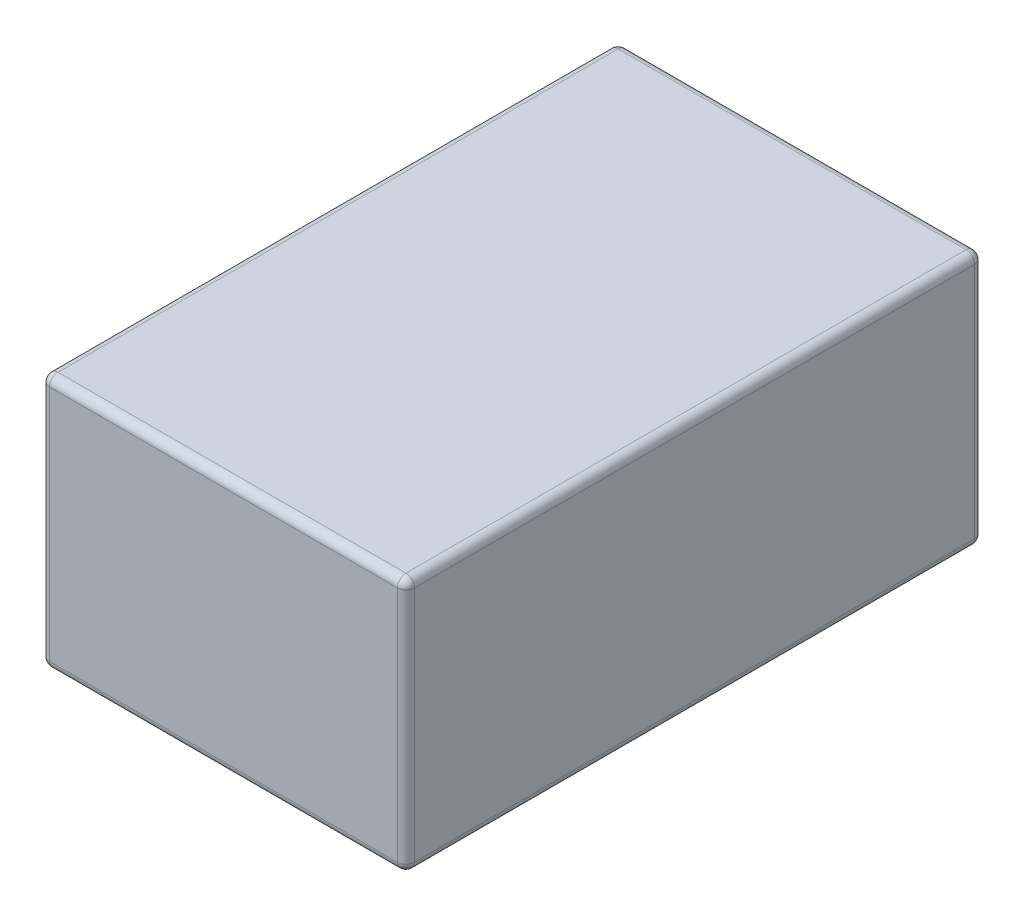
ISO-10303-21;
HEADER;
FILE_DESCRIPTION(('STEP AP214'),'2;1');
FILE_NAME('part.step','',(''),(''),'','','');
FILE_SCHEMA(('AUTOMOTIVE_DESIGN { 1 0 10303 214 1 1 1 1 }'));
ENDSEC;
DATA;
#1=APPLICATION_CONTEXT('core data for automotive mechanical design processes');
#2=APPLICATION_PROTOCOL_DEFINITION('international standard','automotive_design',2000,#1);
#3=PRODUCT_CONTEXT('',#1,'mechanical');
#4=PRODUCT('Part','Part','',(#3));
#5=PRODUCT_RELATED_PRODUCT_CATEGORY('part','',(#4));
#6=PRODUCT_DEFINITION_FORMATION('','',#4);
#7=PRODUCT_DEFINITION_CONTEXT('part definition',#1,'design');
#8=PRODUCT_DEFINITION('design','',#6,#7);
#9=PRODUCT_DEFINITION_SHAPE('','',#8);
#10=(LENGTH_UNIT() NAMED_UNIT(*) SI_UNIT(.MILLI.,.METRE.));
#11=(NAMED_UNIT(*) PLANE_ANGLE_UNIT() SI_UNIT($,.RADIAN.));
#12=(NAMED_UNIT(*) SI_UNIT($,.STERADIAN.) SOLID_ANGLE_UNIT());
#13=UNCERTAINTY_MEASURE_WITH_UNIT(LENGTH_MEASURE(1.E-05),#10,'distance_accuracy_value','');
#14=(GEOMETRIC_REPRESENTATION_CONTEXT(3) GLOBAL_UNCERTAINTY_ASSIGNED_CONTEXT((#13)) GLOBAL_UNIT_ASSIGNED_CONTEXT((#10,
#11,#12)) REPRESENTATION_CONTEXT('',''));
#15=CARTESIAN_POINT('',(0.,0.,0.));
#16=DIRECTION('',(0.,0.,1.));
#17=DIRECTION('',(1.,0.,0.));
#18=AXIS2_PLACEMENT_3D('',#15,#16,#17);
#19=CARTESIAN_POINT('',(0.,0.,172.72));
#20=DIRECTION('',(1.,0.,0.));
#21=DIRECTION('',(0.,0.,-1.));
#22=AXIS2_PLACEMENT_3D('',#19,#20,#21);
#23=PLANE('',#22);
#24=DIRECTION('',(0.,-1.,0.));
#25=VECTOR('',#24,1.);
#26=CARTESIAN_POINT('',(0.,0.,2.53999999999999));
#27=LINE('',#26,#25);
#28=CARTESIAN_POINT('',(0.,73.66,2.53999999999999));
#29=VERTEX_POINT('',#28);
#30=CARTESIAN_POINT('',(0.,2.54,2.53999999999999));
#31=VERTEX_POINT('',#30);
#32=EDGE_CURVE('E139',#29,#31,#27,.T.);
#33=ORIENTED_EDGE('',*,*,#32,.T.);
#34=DIRECTION('',(0.,0.,-1.));
#35=VECTOR('',#34,1.);
#36=CARTESIAN_POINT('',(0.,2.54,172.72));
#37=LINE('',#36,#35);
#38=CARTESIAN_POINT('',(0.,2.54,170.18));
#39=VERTEX_POINT('',#38);
#40=EDGE_CURVE('E135',#31,#39,#37,.F.);
#41=ORIENTED_EDGE('',*,*,#40,.T.);
#42=DIRECTION('',(0.,-1.,0.));
#43=VECTOR('',#42,1.);
#44=CARTESIAN_POINT('',(0.,0.,170.18));
#45=LINE('',#44,#43);
#46=CARTESIAN_POINT('',(0.,73.66,170.18));
#47=VERTEX_POINT('',#46);
#48=EDGE_CURVE('E128',#39,#47,#45,.F.);
#49=ORIENTED_EDGE('',*,*,#48,.T.);
#50=DIRECTION('',(0.,0.,-1.));
#51=VECTOR('',#50,1.);
#52=CARTESIAN_POINT('',(0.,73.66,172.72));
#53=LINE('',#52,#51);
#54=EDGE_CURVE('E132',#47,#29,#53,.T.);
#55=ORIENTED_EDGE('',*,*,#54,.T.);
#56=EDGE_LOOP('',(#33,#41,#49,#55));
#57=FACE_BOUND('',#56,.T.);
#58=ADVANCED_FACE('F41',(#57),#23,.F.);
#59=CARTESIAN_POINT('',(0.,0.,172.72));
#60=DIRECTION('',(0.,1.,0.));
#61=DIRECTION('',(0.,0.,1.));
#62=AXIS2_PLACEMENT_3D('',#59,#60,#61);
#63=PLANE('',#62);
#64=DIRECTION('',(1.,0.,0.));
#65=VECTOR('',#64,1.);
#66=CARTESIAN_POINT('',(0.,0.,170.18));
#67=LINE('',#66,#65);
#68=CARTESIAN_POINT('',(106.68,0.,170.18));
#69=VERTEX_POINT('',#68);
#70=CARTESIAN_POINT('',(2.54,0.,170.18));
#71=VERTEX_POINT('',#70);
#72=EDGE_CURVE('E200',#69,#71,#67,.F.);
#73=ORIENTED_EDGE('',*,*,#72,.T.);
#74=DIRECTION('',(0.,0.,-1.));
#75=VECTOR('',#74,1.);
#76=CARTESIAN_POINT('',(2.54,0.,172.72));
#77=LINE('',#76,#75);
#78=CARTESIAN_POINT('',(2.54,0.,2.53999999999999));
#79=VERTEX_POINT('',#78);
#80=EDGE_CURVE('E202',#71,#79,#77,.T.);
#81=ORIENTED_EDGE('',*,*,#80,.T.);
#82=DIRECTION('',(1.,0.,0.));
#83=VECTOR('',#82,1.);
#84=CARTESIAN_POINT('',(109.22,0.,2.53999999999999));
#85=LINE('',#84,#83);
#86=CARTESIAN_POINT('',(106.68,0.,2.53999999999999));
#87=VERTEX_POINT('',#86);
#88=EDGE_CURVE('E196',#79,#87,#85,.T.);
#89=ORIENTED_EDGE('',*,*,#88,.T.);
#90=DIRECTION('',(0.,0.,-1.));
#91=VECTOR('',#90,1.);
#92=CARTESIAN_POINT('',(106.68,0.,172.72));
#93=LINE('',#92,#91);
#94=EDGE_CURVE('E198',#87,#69,#93,.F.);
#95=ORIENTED_EDGE('',*,*,#94,.T.);
#96=EDGE_LOOP('',(#73,#81,#89,#95));
#97=FACE_BOUND('',#96,.T.);
#98=ADVANCED_FACE('F272',(#97),#63,.F.);
#99=CARTESIAN_POINT('',(109.22,0.,172.72));
#100=DIRECTION('',(-1.,0.,0.));
#101=DIRECTION('',(0.,0.,1.));
#102=AXIS2_PLACEMENT_3D('',#99,#100,#101);
#103=PLANE('',#102);
#104=DIRECTION('',(0.,1.,0.));
#105=VECTOR('',#104,1.);
#106=CARTESIAN_POINT('',(109.22,0.,170.18));
#107=LINE('',#106,#105);
#108=CARTESIAN_POINT('',(109.22,73.66,170.18));
#109=VERTEX_POINT('',#108);
#110=CARTESIAN_POINT('',(109.22,2.54,170.18));
#111=VERTEX_POINT('',#110);
#112=EDGE_CURVE('E181',#109,#111,#107,.F.);
#113=ORIENTED_EDGE('',*,*,#112,.T.);
#114=DIRECTION('',(0.,0.,-1.));
#115=VECTOR('',#114,1.);
#116=CARTESIAN_POINT('',(109.22,2.54,172.72));
#117=LINE('',#116,#115);
#118=CARTESIAN_POINT('',(109.22,2.54,2.53999999999999));
#119=VERTEX_POINT('',#118);
#120=EDGE_CURVE('E186',#111,#119,#117,.T.);
#121=ORIENTED_EDGE('',*,*,#120,.T.);
#122=DIRECTION('',(0.,1.,0.));
#123=VECTOR('',#122,1.);
#124=CARTESIAN_POINT('',(109.22,76.2,2.53999999999999));
#125=LINE('',#124,#123);
#126=CARTESIAN_POINT('',(109.22,73.66,2.53999999999999));
#127=VERTEX_POINT('',#126);
#128=EDGE_CURVE('E183',#119,#127,#125,.T.);
#129=ORIENTED_EDGE('',*,*,#128,.T.);
#130=DIRECTION('',(0.,0.,-1.));
#131=VECTOR('',#130,1.);
#132=CARTESIAN_POINT('',(109.22,73.66,172.72));
#133=LINE('',#132,#131);
#134=EDGE_CURVE('E179',#127,#109,#133,.F.);
#135=ORIENTED_EDGE('',*,*,#134,.T.);
#136=EDGE_LOOP('',(#113,#121,#129,#135));
#137=FACE_BOUND('',#136,.T.);
#138=ADVANCED_FACE('F281',(#137),#103,.F.);
#139=CARTESIAN_POINT('',(0.,76.2,172.72));
#140=DIRECTION('',(0.,-1.,0.));
#141=DIRECTION('',(0.,0.,-1.));
#142=AXIS2_PLACEMENT_3D('',#139,#140,#141);
#143=PLANE('',#142);
#144=DIRECTION('',(-1.,0.,0.));
#145=VECTOR('',#144,1.);
#146=CARTESIAN_POINT('',(0.,76.2,170.18));
#147=LINE('',#146,#145);
#148=CARTESIAN_POINT('',(2.54,76.2,170.18));
#149=VERTEX_POINT('',#148);
#150=CARTESIAN_POINT('',(106.68,76.2,170.18));
#151=VERTEX_POINT('',#150);
#152=EDGE_CURVE('E50',#149,#151,#147,.F.);
#153=ORIENTED_EDGE('',*,*,#152,.T.);
#154=DIRECTION('',(0.,0.,-1.));
#155=VECTOR('',#154,1.);
#156=CARTESIAN_POINT('',(106.68,76.2,172.72));
#157=LINE('',#156,#155);
#158=CARTESIAN_POINT('',(106.68,76.2,2.53999999999999));
#159=VERTEX_POINT('',#158);
#160=EDGE_CURVE('E11',#151,#159,#157,.T.);
#161=ORIENTED_EDGE('',*,*,#160,.T.);
#162=DIRECTION('',(-1.,0.,0.));
#163=VECTOR('',#162,1.);
#164=CARTESIAN_POINT('',(0.,76.2,2.53999999999999));
#165=LINE('',#164,#163);
#166=CARTESIAN_POINT('',(2.54,76.2,2.53999999999999));
#167=VERTEX_POINT('',#166);
#168=EDGE_CURVE('E205',#159,#167,#165,.T.);
#169=ORIENTED_EDGE('',*,*,#168,.T.);
#170=DIRECTION('',(0.,0.,-1.));
#171=VECTOR('',#170,1.);
#172=CARTESIAN_POINT('',(2.54,76.2,172.72));
#173=LINE('',#172,#171);
#174=EDGE_CURVE('E61',#167,#149,#173,.F.);
#175=ORIENTED_EDGE('',*,*,#174,.T.);
#176=EDGE_LOOP('',(#153,#161,#169,#175));
#177=FACE_BOUND('',#176,.T.);
#178=ADVANCED_FACE('F306',(#177),#143,.F.);
#179=CARTESIAN_POINT('',(0.,0.,172.72));
#180=DIRECTION('',(0.,0.,-1.));
#181=DIRECTION('',(-1.,0.,0.));
#182=AXIS2_PLACEMENT_3D('',#179,#180,#181);
#183=PLANE('',#182);
#184=DIRECTION('',(0.,-1.,0.));
#185=VECTOR('',#184,1.);
#186=CARTESIAN_POINT('',(2.54,0.,172.72));
#187=LINE('',#186,#185);
#188=CARTESIAN_POINT('',(2.54,73.66,172.72));
#189=VERTEX_POINT('',#188);
#190=CARTESIAN_POINT('',(2.54,2.54,172.72));
#191=VERTEX_POINT('',#190);
#192=EDGE_CURVE('E146',#189,#191,#187,.T.);
#193=ORIENTED_EDGE('',*,*,#192,.T.);
#194=DIRECTION('',(1.,0.,0.));
#195=VECTOR('',#194,1.);
#196=CARTESIAN_POINT('',(0.,2.54,172.72));
#197=LINE('',#196,#195);
#198=CARTESIAN_POINT('',(106.68,2.54,172.72));
#199=VERTEX_POINT('',#198);
#200=EDGE_CURVE('E194',#191,#199,#197,.T.);
#201=ORIENTED_EDGE('',*,*,#200,.T.);
#202=DIRECTION('',(0.,1.,0.));
#203=VECTOR('',#202,1.);
#204=CARTESIAN_POINT('',(106.68,0.,172.72));
#205=LINE('',#204,#203);
#206=CARTESIAN_POINT('',(106.68,73.66,172.72));
#207=VERTEX_POINT('',#206);
#208=EDGE_CURVE('E191',#199,#207,#205,.T.);
#209=ORIENTED_EDGE('',*,*,#208,.T.);
#210=DIRECTION('',(-1.,0.,0.));
#211=VECTOR('',#210,1.);
#212=CARTESIAN_POINT('',(0.,73.66,172.72));
#213=LINE('',#212,#211);
#214=EDGE_CURVE('E188',#207,#189,#213,.T.);
#215=ORIENTED_EDGE('',*,*,#214,.T.);
#216=EDGE_LOOP('',(#193,#201,#209,#215));
#217=FACE_BOUND('',#216,.T.);
#218=ADVANCED_FACE('F303',(#217),#183,.F.);
#219=CARTESIAN_POINT('',(0.,0.,0.));
#220=DIRECTION('',(0.,0.,-1.));
#221=DIRECTION('',(-1.,0.,0.));
#222=AXIS2_PLACEMENT_3D('',#219,#220,#221);
#223=PLANE('',#222);
#224=DIRECTION('',(0.,1.,0.));
#225=VECTOR('',#224,1.);
#226=CARTESIAN_POINT('',(106.68,0.,0.));
#227=LINE('',#226,#225);
#228=CARTESIAN_POINT('',(106.68,73.66,0.));
#229=VERTEX_POINT('',#228);
#230=CARTESIAN_POINT('',(106.68,2.54,0.));
#231=VERTEX_POINT('',#230);
#232=EDGE_CURVE('E172',#229,#231,#227,.F.);
#233=ORIENTED_EDGE('',*,*,#232,.T.);
#234=DIRECTION('',(1.,0.,0.));
#235=VECTOR('',#234,1.);
#236=CARTESIAN_POINT('',(0.,2.54,0.));
#237=LINE('',#236,#235);
#238=CARTESIAN_POINT('',(2.54,2.54,0.));
#239=VERTEX_POINT('',#238);
#240=EDGE_CURVE('E177',#231,#239,#237,.F.);
#241=ORIENTED_EDGE('',*,*,#240,.T.);
#242=DIRECTION('',(0.,-1.,0.));
#243=VECTOR('',#242,1.);
#244=CARTESIAN_POINT('',(2.54,76.2,0.));
#245=LINE('',#244,#243);
#246=CARTESIAN_POINT('',(2.54,73.66,0.));
#247=VERTEX_POINT('',#246);
#248=EDGE_CURVE('E174',#239,#247,#245,.F.);
#249=ORIENTED_EDGE('',*,*,#248,.T.);
#250=DIRECTION('',(-1.,0.,0.));
#251=VECTOR('',#250,1.);
#252=CARTESIAN_POINT('',(109.22,73.66,0.));
#253=LINE('',#252,#251);
#254=EDGE_CURVE('E170',#247,#229,#253,.F.);
#255=ORIENTED_EDGE('',*,*,#254,.T.);
#256=EDGE_LOOP('',(#233,#241,#249,#255));
#257=FACE_BOUND('',#256,.T.);
#258=ADVANCED_FACE('F305',(#257),#223,.T.);
#259=CARTESIAN_POINT('',(106.68,0.,170.18));
#260=DIRECTION('',(0.,1.,0.));
#261=DIRECTION('',(0.,0.,1.));
#262=AXIS2_PLACEMENT_3D('',#259,#260,#261);
#263=CYLINDRICAL_SURFACE('',#262,2.54);
#264=CARTESIAN_POINT('',(106.68,73.66,170.18));
#265=DIRECTION('',(0.,1.,0.));
#266=DIRECTION('',(0.,0.,1.));
#267=AXIS2_PLACEMENT_3D('',#264,#265,#266);
#268=CIRCLE('',#267,2.54);
#269=EDGE_CURVE('E45',#207,#109,#268,.T.);
#270=ORIENTED_EDGE('',*,*,#269,.F.);
#271=ORIENTED_EDGE('',*,*,#208,.F.);
#272=CARTESIAN_POINT('',(106.68,2.54,170.18));
#273=DIRECTION('',(0.,-1.,0.));
#274=DIRECTION('',(0.,0.,-1.));
#275=AXIS2_PLACEMENT_3D('',#272,#273,#274);
#276=CIRCLE('',#275,2.54);
#277=EDGE_CURVE('E166',#111,#199,#276,.T.);
#278=ORIENTED_EDGE('',*,*,#277,.F.);
#279=ORIENTED_EDGE('',*,*,#112,.F.);
#280=EDGE_LOOP('',(#270,#271,#278,#279));
#281=FACE_BOUND('',#280,.T.);
#282=ADVANCED_FACE('F43',(#281),#263,.T.);
#283=CARTESIAN_POINT('',(106.68,73.66,170.18));
#284=DIRECTION('',(1.,0.,0.));
#285=DIRECTION('',(0.,0.,-1.));
#286=AXIS2_PLACEMENT_3D('',#283,#284,#285);
#287=SPHERICAL_SURFACE('',#286,2.54);
#288=CARTESIAN_POINT('',(106.68,73.66,170.18));
#289=DIRECTION('',(1.,0.,0.));
#290=DIRECTION('',(0.,0.,-1.));
#291=AXIS2_PLACEMENT_3D('',#288,#289,#290);
#292=CIRCLE('',#291,2.54);
#293=EDGE_CURVE('E251',#207,#151,#292,.F.);
#294=ORIENTED_EDGE('',*,*,#293,.F.);
#295=ORIENTED_EDGE('',*,*,#269,.T.);
#296=CARTESIAN_POINT('',(106.68,73.66,170.18));
#297=DIRECTION('',(0.,0.,1.));
#298=DIRECTION('',(1.,0.,0.));
#299=AXIS2_PLACEMENT_3D('',#296,#297,#298);
#300=CIRCLE('',#299,2.54);
#301=EDGE_CURVE('E253',#151,#109,#300,.F.);
#302=ORIENTED_EDGE('',*,*,#301,.F.);
#303=EDGE_LOOP('',(#294,#295,#302));
#304=FACE_BOUND('',#303,.T.);
#305=ADVANCED_FACE('F299',(#304),#287,.T.);
#306=CARTESIAN_POINT('',(106.68,2.54,170.18));
#307=DIRECTION('',(0.,0.,1.));
#308=DIRECTION('',(1.,0.,0.));
#309=AXIS2_PLACEMENT_3D('',#306,#307,#308);
#310=SPHERICAL_SURFACE('',#309,2.54);
#311=CARTESIAN_POINT('',(106.68,2.54,170.18));
#312=DIRECTION('',(0.,0.,1.));
#313=DIRECTION('',(1.,0.,0.));
#314=AXIS2_PLACEMENT_3D('',#311,#312,#313);
#315=CIRCLE('',#314,2.54);
#316=EDGE_CURVE('E245',#111,#69,#315,.F.);
#317=ORIENTED_EDGE('',*,*,#316,.F.);
#318=ORIENTED_EDGE('',*,*,#277,.T.);
#319=CARTESIAN_POINT('',(106.68,2.54,170.18));
#320=DIRECTION('',(1.,0.,0.));
#321=DIRECTION('',(0.,0.,-1.));
#322=AXIS2_PLACEMENT_3D('',#319,#320,#321);
#323=CIRCLE('',#322,2.54);
#324=EDGE_CURVE('E248',#69,#199,#323,.F.);
#325=ORIENTED_EDGE('',*,*,#324,.F.);
#326=EDGE_LOOP('',(#317,#318,#325));
#327=FACE_BOUND('',#326,.T.);
#328=ADVANCED_FACE('F260',(#327),#310,.T.);
#329=CARTESIAN_POINT('',(106.68,73.66,172.72));
#330=DIRECTION('',(0.,0.,-1.));
#331=DIRECTION('',(-1.,0.,0.));
#332=AXIS2_PLACEMENT_3D('',#329,#330,#331);
#333=CYLINDRICAL_SURFACE('',#332,2.54);
#334=ORIENTED_EDGE('',*,*,#301,.T.);
#335=ORIENTED_EDGE('',*,*,#134,.F.);
#336=CARTESIAN_POINT('',(106.68,73.66,2.53999999999999));
#337=DIRECTION('',(0.,0.,-1.));
#338=DIRECTION('',(-1.,0.,0.));
#339=AXIS2_PLACEMENT_3D('',#336,#337,#338);
#340=CIRCLE('',#339,2.54);
#341=EDGE_CURVE('E240',#159,#127,#340,.T.);
#342=ORIENTED_EDGE('',*,*,#341,.F.);
#343=ORIENTED_EDGE('',*,*,#160,.F.);
#344=EDGE_LOOP('',(#334,#335,#342,#343));
#345=FACE_BOUND('',#344,.T.);
#346=ADVANCED_FACE('F293',(#345),#333,.T.);
#347=CARTESIAN_POINT('',(0.,73.66,170.18));
#348=DIRECTION('',(-1.,0.,0.));
#349=DIRECTION('',(0.,0.,1.));
#350=AXIS2_PLACEMENT_3D('',#347,#348,#349);
#351=CYLINDRICAL_SURFACE('',#350,2.54);
#352=ORIENTED_EDGE('',*,*,#293,.T.);
#353=ORIENTED_EDGE('',*,*,#152,.F.);
#354=CARTESIAN_POINT('',(2.54,73.66,170.18));
#355=DIRECTION('',(-1.,0.,0.));
#356=DIRECTION('',(0.,0.,1.));
#357=AXIS2_PLACEMENT_3D('',#354,#355,#356);
#358=CIRCLE('',#357,2.54);
#359=EDGE_CURVE('E150',#189,#149,#358,.T.);
#360=ORIENTED_EDGE('',*,*,#359,.F.);
#361=ORIENTED_EDGE('',*,*,#214,.F.);
#362=EDGE_LOOP('',(#352,#353,#360,#361));
#363=FACE_BOUND('',#362,.T.);
#364=ADVANCED_FACE('F301',(#363),#351,.T.);
#365=CARTESIAN_POINT('',(2.54,0.,170.18));
#366=DIRECTION('',(0.,-1.,0.));
#367=DIRECTION('',(0.,0.,-1.));
#368=AXIS2_PLACEMENT_3D('',#365,#366,#367);
#369=CYLINDRICAL_SURFACE('',#368,2.54);
#370=CARTESIAN_POINT('',(2.54,2.54,170.18));
#371=DIRECTION('',(0.,-1.,0.));
#372=DIRECTION('',(0.,0.,-1.));
#373=AXIS2_PLACEMENT_3D('',#370,#371,#372);
#374=CIRCLE('',#373,2.54);
#375=EDGE_CURVE('E151',#191,#39,#374,.T.);
#376=ORIENTED_EDGE('',*,*,#375,.F.);
#377=ORIENTED_EDGE('',*,*,#192,.F.);
#378=CARTESIAN_POINT('',(2.54,73.66,170.18));
#379=DIRECTION('',(0.,1.,0.));
#380=DIRECTION('',(0.,0.,1.));
#381=AXIS2_PLACEMENT_3D('',#378,#379,#380);
#382=CIRCLE('',#381,2.54);
#383=EDGE_CURVE('E143',#47,#189,#382,.T.);
#384=ORIENTED_EDGE('',*,*,#383,.F.);
#385=ORIENTED_EDGE('',*,*,#48,.F.);
#386=EDGE_LOOP('',(#376,#377,#384,#385));
#387=FACE_BOUND('',#386,.T.);
#388=ADVANCED_FACE('F145',(#387),#369,.T.);
#389=CARTESIAN_POINT('',(0.,2.54,170.18));
#390=DIRECTION('',(1.,0.,0.));
#391=DIRECTION('',(0.,0.,-1.));
#392=AXIS2_PLACEMENT_3D('',#389,#390,#391);
#393=CYLINDRICAL_SURFACE('',#392,2.54);
#394=ORIENTED_EDGE('',*,*,#324,.T.);
#395=ORIENTED_EDGE('',*,*,#200,.F.);
#396=CARTESIAN_POINT('',(2.54,2.54,170.18));
#397=DIRECTION('',(-1.,0.,0.));
#398=DIRECTION('',(0.,0.,1.));
#399=AXIS2_PLACEMENT_3D('',#396,#397,#398);
#400=CIRCLE('',#399,2.54);
#401=EDGE_CURVE('E235',#71,#191,#400,.T.);
#402=ORIENTED_EDGE('',*,*,#401,.F.);
#403=ORIENTED_EDGE('',*,*,#72,.F.);
#404=EDGE_LOOP('',(#394,#395,#402,#403));
#405=FACE_BOUND('',#404,.T.);
#406=ADVANCED_FACE('F268',(#405),#393,.T.);
#407=CARTESIAN_POINT('',(106.68,2.54,172.72));
#408=DIRECTION('',(0.,0.,-1.));
#409=DIRECTION('',(-1.,0.,0.));
#410=AXIS2_PLACEMENT_3D('',#407,#408,#409);
#411=CYLINDRICAL_SURFACE('',#410,2.54);
#412=ORIENTED_EDGE('',*,*,#316,.T.);
#413=ORIENTED_EDGE('',*,*,#94,.F.);
#414=CARTESIAN_POINT('',(106.68,2.54,2.53999999999999));
#415=DIRECTION('',(0.,0.,-1.));
#416=DIRECTION('',(-1.,0.,0.));
#417=AXIS2_PLACEMENT_3D('',#414,#415,#416);
#418=CIRCLE('',#417,2.54);
#419=EDGE_CURVE('E232',#119,#87,#418,.T.);
#420=ORIENTED_EDGE('',*,*,#419,.F.);
#421=ORIENTED_EDGE('',*,*,#120,.F.);
#422=EDGE_LOOP('',(#412,#413,#420,#421));
#423=FACE_BOUND('',#422,.T.);
#424=ADVANCED_FACE('F278',(#423),#411,.T.);
#425=CARTESIAN_POINT('',(106.68,0.,2.53999999999999));
#426=DIRECTION('',(0.,-1.,0.));
#427=DIRECTION('',(0.,0.,-1.));
#428=AXIS2_PLACEMENT_3D('',#425,#426,#427);
#429=CYLINDRICAL_SURFACE('',#428,2.54);
#430=CARTESIAN_POINT('',(106.68,73.66,2.53999999999999));
#431=DIRECTION('',(0.,1.,0.));
#432=DIRECTION('',(0.,0.,1.));
#433=AXIS2_PLACEMENT_3D('',#430,#431,#432);
#434=CIRCLE('',#433,2.54);
#435=EDGE_CURVE('E242',#127,#229,#434,.T.);
#436=ORIENTED_EDGE('',*,*,#435,.F.);
#437=ORIENTED_EDGE('',*,*,#128,.F.);
#438=CARTESIAN_POINT('',(106.68,2.54,2.54));
#439=DIRECTION('',(0.,-1.,0.));
#440=DIRECTION('',(0.,0.,-1.));
#441=AXIS2_PLACEMENT_3D('',#438,#439,#440);
#442=CIRCLE('',#441,2.54);
#443=EDGE_CURVE('E229',#231,#119,#442,.T.);
#444=ORIENTED_EDGE('',*,*,#443,.F.);
#445=ORIENTED_EDGE('',*,*,#232,.F.);
#446=EDGE_LOOP('',(#436,#437,#444,#445));
#447=FACE_BOUND('',#446,.T.);
#448=ADVANCED_FACE('F285',(#447),#429,.T.);
#449=CARTESIAN_POINT('',(106.68,73.66,2.54));
#450=DIRECTION('',(1.,0.,0.));
#451=DIRECTION('',(0.,0.,-1.));
#452=AXIS2_PLACEMENT_3D('',#449,#450,#451);
#453=SPHERICAL_SURFACE('',#452,2.54);
#454=ORIENTED_EDGE('',*,*,#341,.T.);
#455=ORIENTED_EDGE('',*,*,#435,.T.);
#456=CARTESIAN_POINT('',(106.68,73.66,2.54));
#457=DIRECTION('',(1.,0.,0.));
#458=DIRECTION('',(0.,0.,-1.));
#459=AXIS2_PLACEMENT_3D('',#456,#457,#458);
#460=CIRCLE('',#459,2.54);
#461=EDGE_CURVE('E157',#159,#229,#460,.F.);
#462=ORIENTED_EDGE('',*,*,#461,.F.);
#463=EDGE_LOOP('',(#454,#455,#462));
#464=FACE_BOUND('',#463,.T.);
#465=ADVANCED_FACE('F359',(#464),#453,.T.);
#466=CARTESIAN_POINT('',(2.54,73.66,170.18));
#467=DIRECTION('',(0.,0.,1.));
#468=DIRECTION('',(1.,0.,0.));
#469=AXIS2_PLACEMENT_3D('',#466,#467,#468);
#470=SPHERICAL_SURFACE('',#469,2.54);
#471=ORIENTED_EDGE('',*,*,#383,.T.);
#472=ORIENTED_EDGE('',*,*,#359,.T.);
#473=CARTESIAN_POINT('',(2.54,73.66,170.18));
#474=DIRECTION('',(0.,0.,1.));
#475=DIRECTION('',(1.,0.,0.));
#476=AXIS2_PLACEMENT_3D('',#473,#474,#475);
#477=CIRCLE('',#476,2.54);
#478=EDGE_CURVE('E154',#47,#149,#477,.F.);
#479=ORIENTED_EDGE('',*,*,#478,.F.);
#480=EDGE_LOOP('',(#471,#472,#479));
#481=FACE_BOUND('',#480,.T.);
#482=ADVANCED_FACE('F155',(#481),#470,.T.);
#483=CARTESIAN_POINT('',(2.54,2.54,170.18));
#484=DIRECTION('',(0.,0.,1.));
#485=DIRECTION('',(1.,0.,0.));
#486=AXIS2_PLACEMENT_3D('',#483,#484,#485);
#487=SPHERICAL_SURFACE('',#486,2.54);
#488=ORIENTED_EDGE('',*,*,#401,.T.);
#489=ORIENTED_EDGE('',*,*,#375,.T.);
#490=CARTESIAN_POINT('',(2.54,2.54,170.18));
#491=DIRECTION('',(0.,0.,1.));
#492=DIRECTION('',(1.,0.,0.));
#493=AXIS2_PLACEMENT_3D('',#490,#491,#492);
#494=CIRCLE('',#493,2.54);
#495=EDGE_CURVE('E158',#71,#39,#494,.F.);
#496=ORIENTED_EDGE('',*,*,#495,.F.);
#497=EDGE_LOOP('',(#488,#489,#496));
#498=FACE_BOUND('',#497,.T.);
#499=ADVANCED_FACE('F352',(#498),#487,.T.);
#500=CARTESIAN_POINT('',(106.68,2.54,2.54));
#501=DIRECTION('',(1.,0.,0.));
#502=DIRECTION('',(0.,0.,-1.));
#503=AXIS2_PLACEMENT_3D('',#500,#501,#502);
#504=SPHERICAL_SURFACE('',#503,2.54);
#505=ORIENTED_EDGE('',*,*,#443,.T.);
#506=ORIENTED_EDGE('',*,*,#419,.T.);
#507=CARTESIAN_POINT('',(106.68,2.54,2.53999999999999));
#508=DIRECTION('',(1.,0.,0.));
#509=DIRECTION('',(0.,0.,-1.));
#510=AXIS2_PLACEMENT_3D('',#507,#508,#509);
#511=CIRCLE('',#510,2.54);
#512=EDGE_CURVE('E222',#231,#87,#511,.F.);
#513=ORIENTED_EDGE('',*,*,#512,.F.);
#514=EDGE_LOOP('',(#505,#506,#513));
#515=FACE_BOUND('',#514,.T.);
#516=ADVANCED_FACE('F348',(#515),#504,.T.);
#517=CARTESIAN_POINT('',(0.,73.66,2.53999999999999));
#518=DIRECTION('',(1.,0.,0.));
#519=DIRECTION('',(0.,0.,-1.));
#520=AXIS2_PLACEMENT_3D('',#517,#518,#519);
#521=CYLINDRICAL_SURFACE('',#520,2.54);
#522=ORIENTED_EDGE('',*,*,#461,.T.);
#523=ORIENTED_EDGE('',*,*,#254,.F.);
#524=CARTESIAN_POINT('',(2.54,73.66,2.53999999999999));
#525=DIRECTION('',(-1.,0.,0.));
#526=DIRECTION('',(0.,0.,1.));
#527=AXIS2_PLACEMENT_3D('',#524,#525,#526);
#528=CIRCLE('',#527,2.54);
#529=EDGE_CURVE('E219',#167,#247,#528,.T.);
#530=ORIENTED_EDGE('',*,*,#529,.F.);
#531=ORIENTED_EDGE('',*,*,#168,.F.);
#532=EDGE_LOOP('',(#522,#523,#530,#531));
#533=FACE_BOUND('',#532,.T.);
#534=ADVANCED_FACE('F345',(#533),#521,.T.);
#535=CARTESIAN_POINT('',(2.54,73.66,172.72));
#536=DIRECTION('',(0.,0.,-1.));
#537=DIRECTION('',(-1.,0.,0.));
#538=AXIS2_PLACEMENT_3D('',#535,#536,#537);
#539=CYLINDRICAL_SURFACE('',#538,2.54);
#540=ORIENTED_EDGE('',*,*,#478,.T.);
#541=ORIENTED_EDGE('',*,*,#174,.F.);
#542=CARTESIAN_POINT('',(2.54,73.66,2.53999999999999));
#543=DIRECTION('',(0.,0.,-1.));
#544=DIRECTION('',(-1.,0.,0.));
#545=AXIS2_PLACEMENT_3D('',#542,#543,#544);
#546=CIRCLE('',#545,2.54);
#547=EDGE_CURVE('E162',#29,#167,#546,.T.);
#548=ORIENTED_EDGE('',*,*,#547,.F.);
#549=ORIENTED_EDGE('',*,*,#54,.F.);
#550=EDGE_LOOP('',(#540,#541,#548,#549));
#551=FACE_BOUND('',#550,.T.);
#552=ADVANCED_FACE('F160',(#551),#539,.T.);
#553=CARTESIAN_POINT('',(2.54,2.54,172.72));
#554=DIRECTION('',(0.,0.,-1.));
#555=DIRECTION('',(-1.,0.,0.));
#556=AXIS2_PLACEMENT_3D('',#553,#554,#555);
#557=CYLINDRICAL_SURFACE('',#556,2.54);
#558=ORIENTED_EDGE('',*,*,#495,.T.);
#559=ORIENTED_EDGE('',*,*,#40,.F.);
#560=CARTESIAN_POINT('',(2.54,2.54,2.53999999999999));
#561=DIRECTION('',(0.,0.,-1.));
#562=DIRECTION('',(-1.,0.,0.));
#563=AXIS2_PLACEMENT_3D('',#560,#561,#562);
#564=CIRCLE('',#563,2.54);
#565=EDGE_CURVE('E215',#79,#31,#564,.T.);
#566=ORIENTED_EDGE('',*,*,#565,.F.);
#567=ORIENTED_EDGE('',*,*,#80,.F.);
#568=EDGE_LOOP('',(#558,#559,#566,#567));
#569=FACE_BOUND('',#568,.T.);
#570=ADVANCED_FACE('F338',(#569),#557,.T.);
#571=CARTESIAN_POINT('',(0.,2.54,2.53999999999999));
#572=DIRECTION('',(-1.,0.,0.));
#573=DIRECTION('',(0.,0.,1.));
#574=AXIS2_PLACEMENT_3D('',#571,#572,#573);
#575=CYLINDRICAL_SURFACE('',#574,2.54);
#576=ORIENTED_EDGE('',*,*,#512,.T.);
#577=ORIENTED_EDGE('',*,*,#88,.F.);
#578=CARTESIAN_POINT('',(2.54,2.54,2.54));
#579=DIRECTION('',(-1.,0.,0.));
#580=DIRECTION('',(0.,0.,1.));
#581=AXIS2_PLACEMENT_3D('',#578,#579,#580);
#582=CIRCLE('',#581,2.54);
#583=EDGE_CURVE('E213',#239,#79,#582,.T.);
#584=ORIENTED_EDGE('',*,*,#583,.F.);
#585=ORIENTED_EDGE('',*,*,#240,.F.);
#586=EDGE_LOOP('',(#576,#577,#584,#585));
#587=FACE_BOUND('',#586,.T.);
#588=ADVANCED_FACE('F334',(#587),#575,.T.);
#589=CARTESIAN_POINT('',(2.54,73.66,2.54));
#590=DIRECTION('',(0.,1.,0.));
#591=DIRECTION('',(0.,0.,1.));
#592=AXIS2_PLACEMENT_3D('',#589,#590,#591);
#593=SPHERICAL_SURFACE('',#592,2.54);
#594=ORIENTED_EDGE('',*,*,#547,.T.);
#595=ORIENTED_EDGE('',*,*,#529,.T.);
#596=CARTESIAN_POINT('',(2.54,73.66,2.54));
#597=DIRECTION('',(0.,1.,0.));
#598=DIRECTION('',(0.,0.,1.));
#599=AXIS2_PLACEMENT_3D('',#596,#597,#598);
#600=CIRCLE('',#599,2.54);
#601=EDGE_CURVE('E211',#29,#247,#600,.F.);
#602=ORIENTED_EDGE('',*,*,#601,.F.);
#603=EDGE_LOOP('',(#594,#595,#602));
#604=FACE_BOUND('',#603,.T.);
#605=ADVANCED_FACE('F330',(#604),#593,.T.);
#606=CARTESIAN_POINT('',(2.54,2.54,2.54));
#607=DIRECTION('',(0.,-1.,0.));
#608=DIRECTION('',(0.,0.,-1.));
#609=AXIS2_PLACEMENT_3D('',#606,#607,#608);
#610=SPHERICAL_SURFACE('',#609,2.54);
#611=ORIENTED_EDGE('',*,*,#583,.T.);
#612=ORIENTED_EDGE('',*,*,#565,.T.);
#613=CARTESIAN_POINT('',(2.54,2.54,2.53999999999999));
#614=DIRECTION('',(0.,-1.,0.));
#615=DIRECTION('',(0.,0.,-1.));
#616=AXIS2_PLACEMENT_3D('',#613,#614,#615);
#617=CIRCLE('',#616,2.54);
#618=EDGE_CURVE('E209',#239,#31,#617,.F.);
#619=ORIENTED_EDGE('',*,*,#618,.F.);
#620=EDGE_LOOP('',(#611,#612,#619));
#621=FACE_BOUND('',#620,.T.);
#622=ADVANCED_FACE('F326',(#621),#610,.T.);
#623=CARTESIAN_POINT('',(2.54,0.,2.53999999999999));
#624=DIRECTION('',(0.,1.,0.));
#625=DIRECTION('',(0.,0.,1.));
#626=AXIS2_PLACEMENT_3D('',#623,#624,#625);
#627=CYLINDRICAL_SURFACE('',#626,2.54);
#628=ORIENTED_EDGE('',*,*,#601,.T.);
#629=ORIENTED_EDGE('',*,*,#248,.F.);
#630=ORIENTED_EDGE('',*,*,#618,.T.);
#631=ORIENTED_EDGE('',*,*,#32,.F.);
#632=EDGE_LOOP('',(#628,#629,#630,#631));
#633=FACE_BOUND('',#632,.T.);
#634=ADVANCED_FACE('F323',(#633),#627,.T.);
#635=CLOSED_SHELL('',(#58,#98,#138,#178,#218,#258,#282,#305,#328,#346,#364,#388,#406,#424,#448,
#465,#482,#499,#516,#534,#552,#570,#588,#605,#622,#634));
#636=MANIFOLD_SOLID_BREP('B2',#635);
#637=ADVANCED_BREP_SHAPE_REPRESENTATION('',(#18,#636),#14);
#638=SHAPE_DEFINITION_REPRESENTATION(#9,#637);
ENDSEC;
END-ISO-10303-21;
